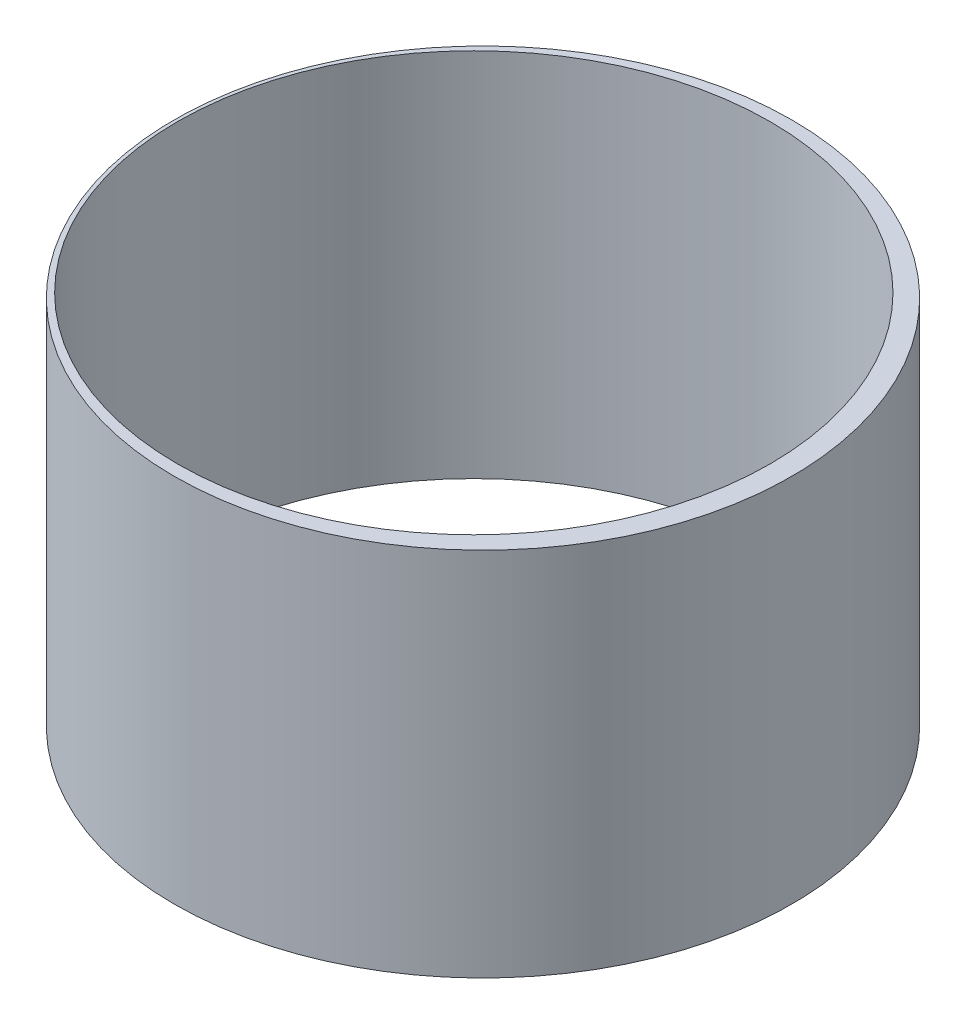
ISO-10303-21;
HEADER;
FILE_DESCRIPTION(('STEP AP214'),'2;1');
FILE_NAME('part.step','',(''),(''),'','','');
FILE_SCHEMA(('AUTOMOTIVE_DESIGN { 1 0 10303 214 1 1 1 1 }'));
ENDSEC;
DATA;
#1=APPLICATION_CONTEXT('core data for automotive mechanical design processes');
#2=APPLICATION_PROTOCOL_DEFINITION('international standard','automotive_design',2000,#1);
#3=PRODUCT_CONTEXT('',#1,'mechanical');
#4=PRODUCT('Part','Part','',(#3));
#5=PRODUCT_RELATED_PRODUCT_CATEGORY('part','',(#4));
#6=PRODUCT_DEFINITION_FORMATION('','',#4);
#7=PRODUCT_DEFINITION_CONTEXT('part definition',#1,'design');
#8=PRODUCT_DEFINITION('design','',#6,#7);
#9=PRODUCT_DEFINITION_SHAPE('','',#8);
#10=(LENGTH_UNIT() NAMED_UNIT(*) SI_UNIT(.MILLI.,.METRE.));
#11=(NAMED_UNIT(*) PLANE_ANGLE_UNIT() SI_UNIT($,.RADIAN.));
#12=(NAMED_UNIT(*) SI_UNIT($,.STERADIAN.) SOLID_ANGLE_UNIT());
#13=UNCERTAINTY_MEASURE_WITH_UNIT(LENGTH_MEASURE(1.E-05),#10,'distance_accuracy_value','');
#14=(GEOMETRIC_REPRESENTATION_CONTEXT(3) GLOBAL_UNCERTAINTY_ASSIGNED_CONTEXT((#13)) GLOBAL_UNIT_ASSIGNED_CONTEXT((#10,
#11,#12)) REPRESENTATION_CONTEXT('',''));
#15=CARTESIAN_POINT('',(0.,0.,0.));
#16=DIRECTION('',(0.,0.,1.));
#17=DIRECTION('',(1.,0.,0.));
#18=AXIS2_PLACEMENT_3D('',#15,#16,#17);
#19=CARTESIAN_POINT('',(0.,30.,0.));
#20=DIRECTION('',(0.,1.,0.));
#21=DIRECTION('',(0.,0.,1.));
#22=AXIS2_PLACEMENT_3D('',#19,#20,#21);
#23=PLANE('',#22);
#24=CARTESIAN_POINT('',(0.,30.,0.));
#25=DIRECTION('',(0.,1.,0.));
#26=DIRECTION('',(0.,0.,1.));
#27=AXIS2_PLACEMENT_3D('',#24,#25,#26);
#28=CIRCLE('',#27,25.);
#29=CARTESIAN_POINT('',(0.,30.,25.));
#30=VERTEX_POINT('',#29);
#31=EDGE_CURVE('E10',#30,#30,#28,.T.);
#32=ORIENTED_EDGE('',*,*,#31,.T.);
#33=EDGE_LOOP('',(#32));
#34=FACE_BOUND('',#33,.T.);
#35=CARTESIAN_POINT('',(-0.744551615294604,30.,0.));
#36=DIRECTION('',(0.,1.,0.));
#37=DIRECTION('',(0.,0.,1.));
#38=AXIS2_PLACEMENT_3D('',#35,#36,#37);
#39=CIRCLE('',#38,24.);
#40=CARTESIAN_POINT('',(-0.744551615294604,30.,24.));
#41=VERTEX_POINT('',#40);
#42=EDGE_CURVE('E48',#41,#41,#39,.T.);
#43=ORIENTED_EDGE('',*,*,#42,.F.);
#44=EDGE_LOOP('',(#43));
#45=FACE_BOUND('',#44,.T.);
#46=ADVANCED_FACE('F37',(#34,#45),#23,.T.);
#47=CARTESIAN_POINT('',(0.,0.,0.));
#48=DIRECTION('',(0.,1.,0.));
#49=DIRECTION('',(0.,0.,1.));
#50=AXIS2_PLACEMENT_3D('',#47,#48,#49);
#51=PLANE('',#50);
#52=CARTESIAN_POINT('',(0.,0.,0.));
#53=DIRECTION('',(0.,1.,0.));
#54=DIRECTION('',(0.,0.,1.));
#55=AXIS2_PLACEMENT_3D('',#52,#53,#54);
#56=CIRCLE('',#55,25.);
#57=CARTESIAN_POINT('',(0.,0.,25.));
#58=VERTEX_POINT('',#57);
#59=EDGE_CURVE('E41',#58,#58,#56,.T.);
#60=ORIENTED_EDGE('',*,*,#59,.F.);
#61=EDGE_LOOP('',(#60));
#62=FACE_BOUND('',#61,.T.);
#63=CARTESIAN_POINT('',(-0.744551615294604,0.,0.));
#64=DIRECTION('',(0.,1.,0.));
#65=DIRECTION('',(0.,0.,1.));
#66=AXIS2_PLACEMENT_3D('',#63,#64,#65);
#67=CIRCLE('',#66,24.);
#68=CARTESIAN_POINT('',(-0.744551615294604,0.,24.));
#69=VERTEX_POINT('',#68);
#70=EDGE_CURVE('E50',#69,#69,#67,.T.);
#71=ORIENTED_EDGE('',*,*,#70,.T.);
#72=EDGE_LOOP('',(#71));
#73=FACE_BOUND('',#72,.T.);
#74=ADVANCED_FACE('F60',(#62,#73),#51,.F.);
#75=CARTESIAN_POINT('',(0.,30.,0.));
#76=DIRECTION('',(0.,-1.,0.));
#77=DIRECTION('',(0.,0.,-1.));
#78=AXIS2_PLACEMENT_3D('',#75,#76,#77);
#79=CYLINDRICAL_SURFACE('',#78,25.);
#80=ORIENTED_EDGE('',*,*,#31,.F.);
#81=EDGE_LOOP('',(#80));
#82=FACE_BOUND('',#81,.T.);
#83=ORIENTED_EDGE('',*,*,#59,.T.);
#84=EDGE_LOOP('',(#83));
#85=FACE_BOUND('',#84,.T.);
#86=ADVANCED_FACE('F39',(#82,#85),#79,.T.);
#87=CARTESIAN_POINT('',(-0.744551615294604,30.,0.));
#88=DIRECTION('',(0.,-1.,0.));
#89=DIRECTION('',(0.,0.,-1.));
#90=AXIS2_PLACEMENT_3D('',#87,#88,#89);
#91=CYLINDRICAL_SURFACE('',#90,24.);
#92=ORIENTED_EDGE('',*,*,#42,.T.);
#93=EDGE_LOOP('',(#92));
#94=FACE_BOUND('',#93,.T.);
#95=ORIENTED_EDGE('',*,*,#70,.F.);
#96=EDGE_LOOP('',(#95));
#97=FACE_BOUND('',#96,.T.);
#98=ADVANCED_FACE('F56',(#94,#97),#91,.F.);
#99=CLOSED_SHELL('',(#46,#74,#86,#98));
#100=MANIFOLD_SOLID_BREP('B2',#99);
#101=ADVANCED_BREP_SHAPE_REPRESENTATION('',(#18,#100),#14);
#102=SHAPE_DEFINITION_REPRESENTATION(#9,#101);
ENDSEC;
END-ISO-10303-21;
